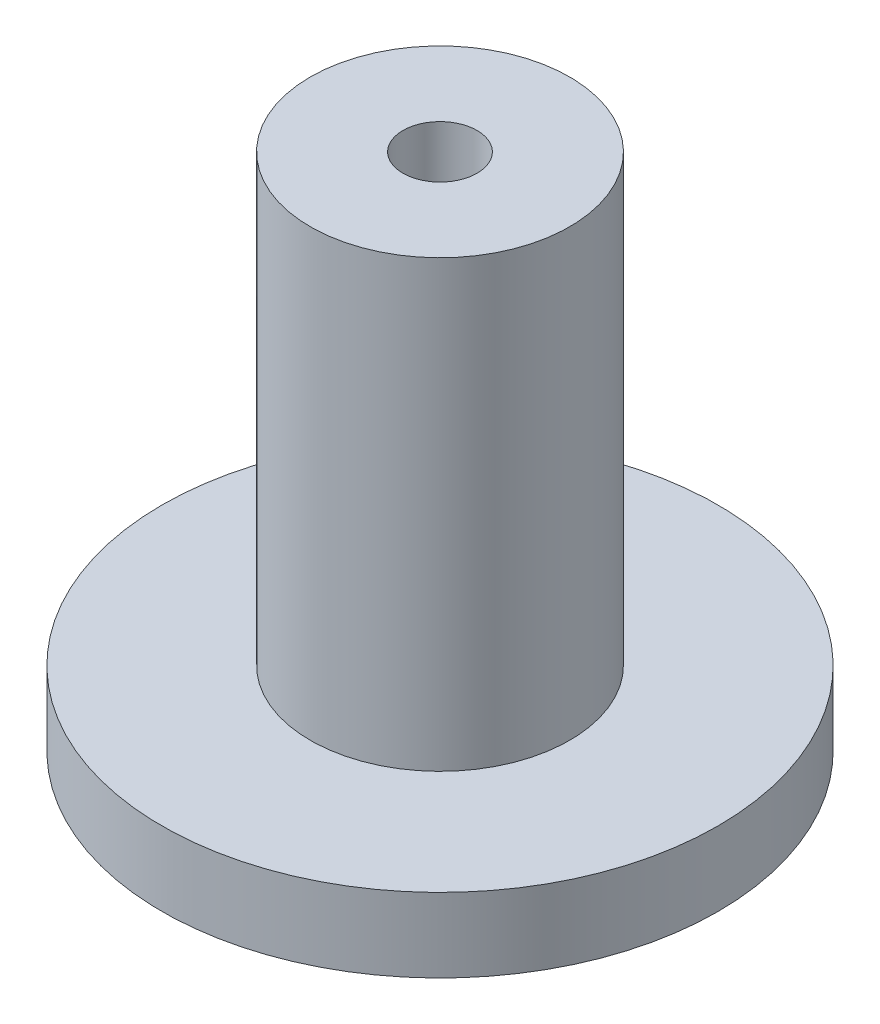
ISO-10303-21;
HEADER;
FILE_DESCRIPTION(('STEP AP214'),'2;1');
FILE_NAME('part.step','',(''),(''),'','','');
FILE_SCHEMA(('AUTOMOTIVE_DESIGN { 1 0 10303 214 1 1 1 1 }'));
ENDSEC;
DATA;
#1=APPLICATION_CONTEXT('core data for automotive mechanical design processes');
#2=APPLICATION_PROTOCOL_DEFINITION('international standard','automotive_design',2000,#1);
#3=PRODUCT_CONTEXT('',#1,'mechanical');
#4=PRODUCT('Part','Part','',(#3));
#5=PRODUCT_RELATED_PRODUCT_CATEGORY('part','',(#4));
#6=PRODUCT_DEFINITION_FORMATION('','',#4);
#7=PRODUCT_DEFINITION_CONTEXT('part definition',#1,'design');
#8=PRODUCT_DEFINITION('design','',#6,#7);
#9=PRODUCT_DEFINITION_SHAPE('','',#8);
#10=(LENGTH_UNIT() NAMED_UNIT(*) SI_UNIT(.MILLI.,.METRE.));
#11=(NAMED_UNIT(*) PLANE_ANGLE_UNIT() SI_UNIT($,.RADIAN.));
#12=(NAMED_UNIT(*) SI_UNIT($,.STERADIAN.) SOLID_ANGLE_UNIT());
#13=UNCERTAINTY_MEASURE_WITH_UNIT(LENGTH_MEASURE(1.E-05),#10,'distance_accuracy_value','');
#14=(GEOMETRIC_REPRESENTATION_CONTEXT(3) GLOBAL_UNCERTAINTY_ASSIGNED_CONTEXT((#13)) GLOBAL_UNIT_ASSIGNED_CONTEXT((#10,
#11,#12)) REPRESENTATION_CONTEXT('',''));
#15=CARTESIAN_POINT('',(0.,0.,0.));
#16=DIRECTION('',(0.,0.,1.));
#17=DIRECTION('',(1.,0.,0.));
#18=AXIS2_PLACEMENT_3D('',#15,#16,#17);
#19=CARTESIAN_POINT('',(0.,6.31830165401301,0.));
#20=DIRECTION('',(0.,1.,0.));
#21=DIRECTION('',(-1.,0.,0.));
#22=AXIS2_PLACEMENT_3D('',#19,#20,#21);
#23=CYLINDRICAL_SURFACE('',#22,1.5875);
#24=CARTESIAN_POINT('',(0.,19.05,0.));
#25=DIRECTION('',(0.,1.,0.));
#26=DIRECTION('',(-1.,0.,0.));
#27=AXIS2_PLACEMENT_3D('',#24,#25,#26);
#28=CIRCLE('',#27,1.5875);
#29=CARTESIAN_POINT('',(-1.5875,19.05,0.));
#30=VERTEX_POINT('',#29);
#31=EDGE_CURVE('E59',#30,#30,#28,.T.);
#32=ORIENTED_EDGE('',*,*,#31,.F.);
#33=EDGE_LOOP('',(#32));
#34=FACE_BOUND('',#33,.T.);
#35=CARTESIAN_POINT('',(0.,22.225,0.));
#36=DIRECTION('',(0.,1.,0.));
#37=DIRECTION('',(-1.,0.,0.));
#38=AXIS2_PLACEMENT_3D('',#35,#36,#37);
#39=CIRCLE('',#38,1.5875);
#40=CARTESIAN_POINT('',(-1.5875,22.225,0.));
#41=VERTEX_POINT('',#40);
#42=EDGE_CURVE('E10',#41,#41,#39,.T.);
#43=ORIENTED_EDGE('',*,*,#42,.T.);
#44=EDGE_LOOP('',(#43));
#45=FACE_BOUND('',#44,.T.);
#46=ADVANCED_FACE('F31',(#34,#45),#23,.F.);
#47=CARTESIAN_POINT('',(1.5875,22.225,0.));
#48=DIRECTION('',(0.,-1.,0.));
#49=DIRECTION('',(1.,0.,0.));
#50=AXIS2_PLACEMENT_3D('',#47,#48,#49);
#51=PLANE('',#50);
#52=ORIENTED_EDGE('',*,*,#42,.F.);
#53=EDGE_LOOP('',(#52));
#54=FACE_BOUND('',#53,.T.);
#55=CARTESIAN_POINT('',(0.,22.225,0.));
#56=DIRECTION('',(0.,1.,0.));
#57=DIRECTION('',(-1.,0.,0.));
#58=AXIS2_PLACEMENT_3D('',#55,#56,#57);
#59=CIRCLE('',#58,5.55625);
#60=CARTESIAN_POINT('',(-5.55625,22.225,0.));
#61=VERTEX_POINT('',#60);
#62=EDGE_CURVE('E37',#61,#61,#59,.T.);
#63=ORIENTED_EDGE('',*,*,#62,.T.);
#64=EDGE_LOOP('',(#63));
#65=FACE_BOUND('',#64,.T.);
#66=ADVANCED_FACE('F66',(#54,#65),#51,.F.);
#67=CARTESIAN_POINT('',(0.,6.31830165401301,0.));
#68=DIRECTION('',(0.,1.,0.));
#69=DIRECTION('',(-1.,0.,0.));
#70=AXIS2_PLACEMENT_3D('',#67,#68,#69);
#71=CYLINDRICAL_SURFACE('',#70,5.55625);
#72=ORIENTED_EDGE('',*,*,#62,.F.);
#73=EDGE_LOOP('',(#72));
#74=FACE_BOUND('',#73,.T.);
#75=CARTESIAN_POINT('',(0.,3.175,0.));
#76=DIRECTION('',(0.,1.,0.));
#77=DIRECTION('',(-1.,0.,0.));
#78=AXIS2_PLACEMENT_3D('',#75,#76,#77);
#79=CIRCLE('',#78,5.55625);
#80=CARTESIAN_POINT('',(-5.55625,3.175,0.));
#81=VERTEX_POINT('',#80);
#82=EDGE_CURVE('E41',#81,#81,#79,.T.);
#83=ORIENTED_EDGE('',*,*,#82,.T.);
#84=EDGE_LOOP('',(#83));
#85=FACE_BOUND('',#84,.T.);
#86=ADVANCED_FACE('F70',(#74,#85),#71,.T.);
#87=CARTESIAN_POINT('',(5.55625,3.175,0.));
#88=DIRECTION('',(0.,-1.,0.));
#89=DIRECTION('',(1.,0.,0.));
#90=AXIS2_PLACEMENT_3D('',#87,#88,#89);
#91=PLANE('',#90);
#92=ORIENTED_EDGE('',*,*,#82,.F.);
#93=EDGE_LOOP('',(#92));
#94=FACE_BOUND('',#93,.T.);
#95=CARTESIAN_POINT('',(0.,3.175,0.));
#96=DIRECTION('',(0.,1.,0.));
#97=DIRECTION('',(-1.,0.,0.));
#98=AXIS2_PLACEMENT_3D('',#95,#96,#97);
#99=CIRCLE('',#98,11.90625);
#100=CARTESIAN_POINT('',(-11.90625,3.175,0.));
#101=VERTEX_POINT('',#100);
#102=EDGE_CURVE('E45',#101,#101,#99,.T.);
#103=ORIENTED_EDGE('',*,*,#102,.T.);
#104=EDGE_LOOP('',(#103));
#105=FACE_BOUND('',#104,.T.);
#106=ADVANCED_FACE('F75',(#94,#105),#91,.F.);
#107=CARTESIAN_POINT('',(0.,6.31830165401301,0.));
#108=DIRECTION('',(0.,1.,0.));
#109=DIRECTION('',(-1.,0.,0.));
#110=AXIS2_PLACEMENT_3D('',#107,#108,#109);
#111=CYLINDRICAL_SURFACE('',#110,11.90625);
#112=ORIENTED_EDGE('',*,*,#102,.F.);
#113=EDGE_LOOP('',(#112));
#114=FACE_BOUND('',#113,.T.);
#115=CARTESIAN_POINT('',(0.,0.,0.));
#116=DIRECTION('',(0.,1.,0.));
#117=DIRECTION('',(-1.,0.,0.));
#118=AXIS2_PLACEMENT_3D('',#115,#116,#117);
#119=CIRCLE('',#118,11.90625);
#120=CARTESIAN_POINT('',(-11.90625,0.,0.));
#121=VERTEX_POINT('',#120);
#122=EDGE_CURVE('E50',#121,#121,#119,.T.);
#123=ORIENTED_EDGE('',*,*,#122,.T.);
#124=EDGE_LOOP('',(#123));
#125=FACE_BOUND('',#124,.T.);
#126=ADVANCED_FACE('F81',(#114,#125),#111,.T.);
#127=CARTESIAN_POINT('',(11.90625,0.,0.));
#128=DIRECTION('',(0.,1.,0.));
#129=DIRECTION('',(-1.,0.,0.));
#130=AXIS2_PLACEMENT_3D('',#127,#128,#129);
#131=PLANE('',#130);
#132=ORIENTED_EDGE('',*,*,#122,.F.);
#133=EDGE_LOOP('',(#132));
#134=FACE_BOUND('',#133,.T.);
#135=CARTESIAN_POINT('',(0.,0.,0.));
#136=DIRECTION('',(0.,1.,0.));
#137=DIRECTION('',(-1.,0.,0.));
#138=AXIS2_PLACEMENT_3D('',#135,#136,#137);
#139=CIRCLE('',#138,2.38125);
#140=CARTESIAN_POINT('',(-2.38125,0.,0.));
#141=VERTEX_POINT('',#140);
#142=EDGE_CURVE('E53',#141,#141,#139,.T.);
#143=ORIENTED_EDGE('',*,*,#142,.T.);
#144=EDGE_LOOP('',(#143));
#145=FACE_BOUND('',#144,.T.);
#146=ADVANCED_FACE('F85',(#134,#145),#131,.F.);
#147=CARTESIAN_POINT('',(0.,6.31830165401301,0.));
#148=DIRECTION('',(0.,1.,0.));
#149=DIRECTION('',(-1.,0.,0.));
#150=AXIS2_PLACEMENT_3D('',#147,#148,#149);
#151=CYLINDRICAL_SURFACE('',#150,2.38125);
#152=ORIENTED_EDGE('',*,*,#142,.F.);
#153=EDGE_LOOP('',(#152));
#154=FACE_BOUND('',#153,.T.);
#155=CARTESIAN_POINT('',(0.,19.05,0.));
#156=DIRECTION('',(0.,1.,0.));
#157=DIRECTION('',(-1.,0.,0.));
#158=AXIS2_PLACEMENT_3D('',#155,#156,#157);
#159=CIRCLE('',#158,2.38125);
#160=CARTESIAN_POINT('',(-2.38125,19.05,0.));
#161=VERTEX_POINT('',#160);
#162=EDGE_CURVE('E56',#161,#161,#159,.T.);
#163=ORIENTED_EDGE('',*,*,#162,.T.);
#164=EDGE_LOOP('',(#163));
#165=FACE_BOUND('',#164,.T.);
#166=ADVANCED_FACE('F89',(#154,#165),#151,.F.);
#167=CARTESIAN_POINT('',(2.38125,19.05,0.));
#168=DIRECTION('',(0.,1.,0.));
#169=DIRECTION('',(-1.,0.,0.));
#170=AXIS2_PLACEMENT_3D('',#167,#168,#169);
#171=PLANE('',#170);
#172=ORIENTED_EDGE('',*,*,#162,.F.);
#173=EDGE_LOOP('',(#172));
#174=FACE_BOUND('',#173,.T.);
#175=ORIENTED_EDGE('',*,*,#31,.T.);
#176=EDGE_LOOP('',(#175));
#177=FACE_BOUND('',#176,.T.);
#178=ADVANCED_FACE('F63',(#174,#177),#171,.F.);
#179=CLOSED_SHELL('',(#46,#66,#86,#106,#126,#146,#166,#178));
#180=MANIFOLD_SOLID_BREP('B2',#179);
#181=ADVANCED_BREP_SHAPE_REPRESENTATION('',(#18,#180),#14);
#182=SHAPE_DEFINITION_REPRESENTATION(#9,#181);
ENDSEC;
END-ISO-10303-21;
